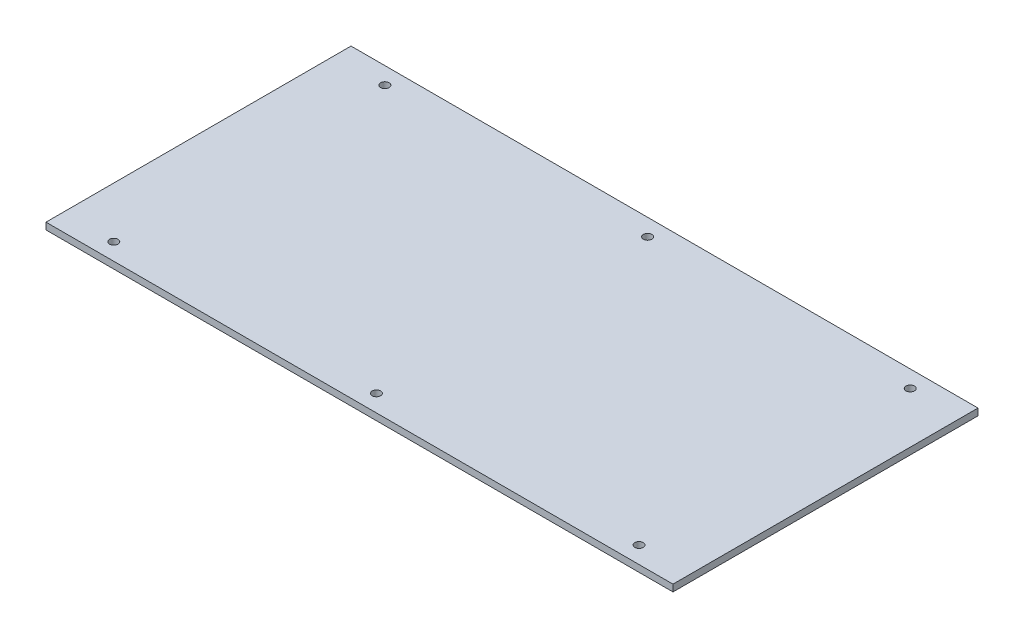
ISO-10303-21;
HEADER;
FILE_DESCRIPTION(('STEP AP214'),'2;1');
FILE_NAME('part.step','',(''),(''),'','','');
FILE_SCHEMA(('AUTOMOTIVE_DESIGN { 1 0 10303 214 1 1 1 1 }'));
ENDSEC;
DATA;
#1=APPLICATION_CONTEXT('core data for automotive mechanical design processes');
#2=APPLICATION_PROTOCOL_DEFINITION('international standard','automotive_design',2000,#1);
#3=PRODUCT_CONTEXT('',#1,'mechanical');
#4=PRODUCT('Part','Part','',(#3));
#5=PRODUCT_RELATED_PRODUCT_CATEGORY('part','',(#4));
#6=PRODUCT_DEFINITION_FORMATION('','',#4);
#7=PRODUCT_DEFINITION_CONTEXT('part definition',#1,'design');
#8=PRODUCT_DEFINITION('design','',#6,#7);
#9=PRODUCT_DEFINITION_SHAPE('','',#8);
#10=(LENGTH_UNIT() NAMED_UNIT(*) SI_UNIT(.MILLI.,.METRE.));
#11=(NAMED_UNIT(*) PLANE_ANGLE_UNIT() SI_UNIT($,.RADIAN.));
#12=(NAMED_UNIT(*) SI_UNIT($,.STERADIAN.) SOLID_ANGLE_UNIT());
#13=UNCERTAINTY_MEASURE_WITH_UNIT(LENGTH_MEASURE(1.E-05),#10,'distance_accuracy_value','');
#14=(GEOMETRIC_REPRESENTATION_CONTEXT(3) GLOBAL_UNCERTAINTY_ASSIGNED_CONTEXT((#13)) GLOBAL_UNIT_ASSIGNED_CONTEXT((#10,
#11,#12)) REPRESENTATION_CONTEXT('',''));
#15=CARTESIAN_POINT('',(0.,0.,0.));
#16=DIRECTION('',(0.,0.,1.));
#17=DIRECTION('',(1.,0.,0.));
#18=AXIS2_PLACEMENT_3D('',#15,#16,#17);
#19=CARTESIAN_POINT('',(0.,4.,0.));
#20=DIRECTION('',(0.,-1.,0.));
#21=DIRECTION('',(0.,0.,-1.));
#22=AXIS2_PLACEMENT_3D('',#19,#20,#21);
#23=PLANE('',#22);
#24=DIRECTION('',(0.,0.,-1.));
#25=VECTOR('',#24,1.);
#26=CARTESIAN_POINT('',(185.,4.,90.));
#27=LINE('',#26,#25);
#28=CARTESIAN_POINT('',(185.,4.,90.));
#29=VERTEX_POINT('',#28);
#30=CARTESIAN_POINT('',(185.,4.,-90.));
#31=VERTEX_POINT('',#30);
#32=EDGE_CURVE('E88',#29,#31,#27,.T.);
#33=ORIENTED_EDGE('',*,*,#32,.T.);
#34=DIRECTION('',(-1.,0.,0.));
#35=VECTOR('',#34,1.);
#36=CARTESIAN_POINT('',(-185.,4.,-90.));
#37=LINE('',#36,#35);
#38=CARTESIAN_POINT('',(-185.,4.,-90.));
#39=VERTEX_POINT('',#38);
#40=EDGE_CURVE('E83',#31,#39,#37,.T.);
#41=ORIENTED_EDGE('',*,*,#40,.T.);
#42=DIRECTION('',(0.,0.,1.));
#43=VECTOR('',#42,1.);
#44=CARTESIAN_POINT('',(-185.,4.,90.));
#45=LINE('',#44,#43);
#46=CARTESIAN_POINT('',(-185.,4.,90.));
#47=VERTEX_POINT('',#46);
#48=EDGE_CURVE('E86',#39,#47,#45,.T.);
#49=ORIENTED_EDGE('',*,*,#48,.T.);
#50=DIRECTION('',(1.,0.,0.));
#51=VECTOR('',#50,1.);
#52=CARTESIAN_POINT('',(-185.,4.,90.));
#53=LINE('',#52,#51);
#54=EDGE_CURVE('E53',#47,#29,#53,.T.);
#55=ORIENTED_EDGE('',*,*,#54,.T.);
#56=EDGE_LOOP('',(#33,#41,#49,#55));
#57=FACE_BOUND('',#56,.T.);
#58=CARTESIAN_POINT('',(-155.,4.,-80.));
#59=DIRECTION('',(0.,1.,0.));
#60=DIRECTION('',(0.,0.,1.));
#61=AXIS2_PLACEMENT_3D('',#58,#59,#60);
#62=CIRCLE('',#61,2.5);
#63=CARTESIAN_POINT('',(-155.,4.,-77.5));
#64=VERTEX_POINT('',#63);
#65=EDGE_CURVE('E103',#64,#64,#62,.T.);
#66=ORIENTED_EDGE('',*,*,#65,.F.);
#67=EDGE_LOOP('',(#66));
#68=FACE_BOUND('',#67,.T.);
#69=CARTESIAN_POINT('',(155.,4.,-80.));
#70=DIRECTION('',(0.,1.,0.));
#71=DIRECTION('',(0.,0.,-1.));
#72=AXIS2_PLACEMENT_3D('',#69,#70,#71);
#73=CIRCLE('',#72,2.5);
#74=CARTESIAN_POINT('',(155.,4.,-82.5));
#75=VERTEX_POINT('',#74);
#76=EDGE_CURVE('E118',#75,#75,#73,.T.);
#77=ORIENTED_EDGE('',*,*,#76,.F.);
#78=EDGE_LOOP('',(#77));
#79=FACE_BOUND('',#78,.T.);
#80=CARTESIAN_POINT('',(0.,4.,-80.));
#81=DIRECTION('',(0.,1.,0.));
#82=DIRECTION('',(0.,0.,1.));
#83=AXIS2_PLACEMENT_3D('',#80,#81,#82);
#84=CIRCLE('',#83,2.5);
#85=CARTESIAN_POINT('',(0.,4.,-77.5));
#86=VERTEX_POINT('',#85);
#87=EDGE_CURVE('E124',#86,#86,#84,.T.);
#88=ORIENTED_EDGE('',*,*,#87,.F.);
#89=EDGE_LOOP('',(#88));
#90=FACE_BOUND('',#89,.T.);
#91=CARTESIAN_POINT('',(-155.,4.,80.));
#92=DIRECTION('',(0.,1.,0.));
#93=DIRECTION('',(0.,0.,-1.));
#94=AXIS2_PLACEMENT_3D('',#91,#92,#93);
#95=CIRCLE('',#94,2.5);
#96=CARTESIAN_POINT('',(-155.,4.,77.5));
#97=VERTEX_POINT('',#96);
#98=EDGE_CURVE('E130',#97,#97,#95,.T.);
#99=ORIENTED_EDGE('',*,*,#98,.F.);
#100=EDGE_LOOP('',(#99));
#101=FACE_BOUND('',#100,.T.);
#102=CARTESIAN_POINT('',(0.,4.,80.0000000000001));
#103=DIRECTION('',(0.,1.,0.));
#104=DIRECTION('',(0.,0.,-1.));
#105=AXIS2_PLACEMENT_3D('',#102,#103,#104);
#106=CIRCLE('',#105,2.5);
#107=CARTESIAN_POINT('',(0.,4.,77.5000000000001));
#108=VERTEX_POINT('',#107);
#109=EDGE_CURVE('E136',#108,#108,#106,.T.);
#110=ORIENTED_EDGE('',*,*,#109,.F.);
#111=EDGE_LOOP('',(#110));
#112=FACE_BOUND('',#111,.T.);
#113=CARTESIAN_POINT('',(155.,4.,80.));
#114=DIRECTION('',(0.,1.,0.));
#115=DIRECTION('',(0.,0.,1.));
#116=AXIS2_PLACEMENT_3D('',#113,#114,#115);
#117=CIRCLE('',#116,2.5);
#118=CARTESIAN_POINT('',(155.,4.,82.5));
#119=VERTEX_POINT('',#118);
#120=EDGE_CURVE('E142',#119,#119,#117,.T.);
#121=ORIENTED_EDGE('',*,*,#120,.F.);
#122=EDGE_LOOP('',(#121));
#123=FACE_BOUND('',#122,.T.);
#124=ADVANCED_FACE('F36',(#57,#68,#79,#90,#101,#112,#123),#23,.F.);
#125=CARTESIAN_POINT('',(0.,0.,0.));
#126=DIRECTION('',(0.,-1.,0.));
#127=DIRECTION('',(0.,0.,-1.));
#128=AXIS2_PLACEMENT_3D('',#125,#126,#127);
#129=PLANE('',#128);
#130=CARTESIAN_POINT('',(0.,0.,80.0000000000001));
#131=DIRECTION('',(0.,1.,0.));
#132=DIRECTION('',(0.,0.,-1.));
#133=AXIS2_PLACEMENT_3D('',#130,#131,#132);
#134=CIRCLE('',#133,2.5);
#135=CARTESIAN_POINT('',(0.,0.,77.5000000000001));
#136=VERTEX_POINT('',#135);
#137=EDGE_CURVE('E139',#136,#136,#134,.T.);
#138=ORIENTED_EDGE('',*,*,#137,.T.);
#139=EDGE_LOOP('',(#138));
#140=FACE_BOUND('',#139,.T.);
#141=CARTESIAN_POINT('',(0.,0.,-80.));
#142=DIRECTION('',(0.,1.,0.));
#143=DIRECTION('',(0.,0.,1.));
#144=AXIS2_PLACEMENT_3D('',#141,#142,#143);
#145=CIRCLE('',#144,2.5);
#146=CARTESIAN_POINT('',(0.,0.,-77.5));
#147=VERTEX_POINT('',#146);
#148=EDGE_CURVE('E127',#147,#147,#145,.T.);
#149=ORIENTED_EDGE('',*,*,#148,.T.);
#150=EDGE_LOOP('',(#149));
#151=FACE_BOUND('',#150,.T.);
#152=CARTESIAN_POINT('',(-155.,0.,-80.));
#153=DIRECTION('',(0.,1.,0.));
#154=DIRECTION('',(0.,0.,1.));
#155=AXIS2_PLACEMENT_3D('',#152,#153,#154);
#156=CIRCLE('',#155,2.5);
#157=CARTESIAN_POINT('',(-155.,0.,-77.5));
#158=VERTEX_POINT('',#157);
#159=EDGE_CURVE('E115',#158,#158,#156,.T.);
#160=ORIENTED_EDGE('',*,*,#159,.T.);
#161=EDGE_LOOP('',(#160));
#162=FACE_BOUND('',#161,.T.);
#163=DIRECTION('',(0.,0.,-1.));
#164=VECTOR('',#163,1.);
#165=CARTESIAN_POINT('',(185.,0.,90.));
#166=LINE('',#165,#164);
#167=CARTESIAN_POINT('',(185.,0.,90.));
#168=VERTEX_POINT('',#167);
#169=CARTESIAN_POINT('',(185.,0.,-90.));
#170=VERTEX_POINT('',#169);
#171=EDGE_CURVE('E100',#168,#170,#166,.T.);
#172=ORIENTED_EDGE('',*,*,#171,.F.);
#173=DIRECTION('',(1.,0.,0.));
#174=VECTOR('',#173,1.);
#175=CARTESIAN_POINT('',(-185.,0.,90.));
#176=LINE('',#175,#174);
#177=CARTESIAN_POINT('',(-185.,0.,90.));
#178=VERTEX_POINT('',#177);
#179=EDGE_CURVE('E76',#178,#168,#176,.T.);
#180=ORIENTED_EDGE('',*,*,#179,.F.);
#181=DIRECTION('',(0.,0.,1.));
#182=VECTOR('',#181,1.);
#183=CARTESIAN_POINT('',(-185.,0.,90.));
#184=LINE('',#183,#182);
#185=CARTESIAN_POINT('',(-185.,0.,-90.));
#186=VERTEX_POINT('',#185);
#187=EDGE_CURVE('E70',#186,#178,#184,.T.);
#188=ORIENTED_EDGE('',*,*,#187,.F.);
#189=DIRECTION('',(-1.,0.,0.));
#190=VECTOR('',#189,1.);
#191=CARTESIAN_POINT('',(-185.,0.,-90.));
#192=LINE('',#191,#190);
#193=EDGE_CURVE('E92',#170,#186,#192,.T.);
#194=ORIENTED_EDGE('',*,*,#193,.F.);
#195=EDGE_LOOP('',(#172,#180,#188,#194));
#196=FACE_BOUND('',#195,.T.);
#197=CARTESIAN_POINT('',(155.,0.,-80.));
#198=DIRECTION('',(0.,1.,0.));
#199=DIRECTION('',(0.,0.,-1.));
#200=AXIS2_PLACEMENT_3D('',#197,#198,#199);
#201=CIRCLE('',#200,2.5);
#202=CARTESIAN_POINT('',(155.,0.,-82.5));
#203=VERTEX_POINT('',#202);
#204=EDGE_CURVE('E121',#203,#203,#201,.T.);
#205=ORIENTED_EDGE('',*,*,#204,.T.);
#206=EDGE_LOOP('',(#205));
#207=FACE_BOUND('',#206,.T.);
#208=CARTESIAN_POINT('',(-155.,0.,80.));
#209=DIRECTION('',(0.,1.,0.));
#210=DIRECTION('',(0.,0.,-1.));
#211=AXIS2_PLACEMENT_3D('',#208,#209,#210);
#212=CIRCLE('',#211,2.5);
#213=CARTESIAN_POINT('',(-155.,0.,77.5));
#214=VERTEX_POINT('',#213);
#215=EDGE_CURVE('E133',#214,#214,#212,.T.);
#216=ORIENTED_EDGE('',*,*,#215,.T.);
#217=EDGE_LOOP('',(#216));
#218=FACE_BOUND('',#217,.T.);
#219=CARTESIAN_POINT('',(155.,0.,80.));
#220=DIRECTION('',(0.,1.,0.));
#221=DIRECTION('',(0.,0.,1.));
#222=AXIS2_PLACEMENT_3D('',#219,#220,#221);
#223=CIRCLE('',#222,2.5);
#224=CARTESIAN_POINT('',(155.,0.,82.5));
#225=VERTEX_POINT('',#224);
#226=EDGE_CURVE('E145',#225,#225,#223,.T.);
#227=ORIENTED_EDGE('',*,*,#226,.T.);
#228=EDGE_LOOP('',(#227));
#229=FACE_BOUND('',#228,.T.);
#230=ADVANCED_FACE('F111',(#140,#151,#162,#196,#207,#218,#229),#129,.T.);
#231=CARTESIAN_POINT('',(185.,4.,90.));
#232=DIRECTION('',(-1.,0.,0.));
#233=DIRECTION('',(0.,0.,1.));
#234=AXIS2_PLACEMENT_3D('',#231,#232,#233);
#235=PLANE('',#234);
#236=ORIENTED_EDGE('',*,*,#171,.T.);
#237=DIRECTION('',(0.,-1.,0.));
#238=VECTOR('',#237,1.);
#239=CARTESIAN_POINT('',(185.,4.,-90.));
#240=LINE('',#239,#238);
#241=EDGE_CURVE('E11',#31,#170,#240,.T.);
#242=ORIENTED_EDGE('',*,*,#241,.F.);
#243=ORIENTED_EDGE('',*,*,#32,.F.);
#244=DIRECTION('',(0.,-1.,0.));
#245=VECTOR('',#244,1.);
#246=CARTESIAN_POINT('',(185.,4.,90.));
#247=LINE('',#246,#245);
#248=EDGE_CURVE('E96',#29,#168,#247,.T.);
#249=ORIENTED_EDGE('',*,*,#248,.T.);
#250=EDGE_LOOP('',(#236,#242,#243,#249));
#251=FACE_BOUND('',#250,.T.);
#252=ADVANCED_FACE('F38',(#251),#235,.F.);
#253=CARTESIAN_POINT('',(-185.,4.,-90.));
#254=DIRECTION('',(0.,0.,1.));
#255=DIRECTION('',(1.,0.,0.));
#256=AXIS2_PLACEMENT_3D('',#253,#254,#255);
#257=PLANE('',#256);
#258=ORIENTED_EDGE('',*,*,#193,.T.);
#259=DIRECTION('',(0.,-1.,0.));
#260=VECTOR('',#259,1.);
#261=CARTESIAN_POINT('',(-185.,4.,-90.));
#262=LINE('',#261,#260);
#263=EDGE_CURVE('E45',#39,#186,#262,.T.);
#264=ORIENTED_EDGE('',*,*,#263,.F.);
#265=ORIENTED_EDGE('',*,*,#40,.F.);
#266=ORIENTED_EDGE('',*,*,#241,.T.);
#267=EDGE_LOOP('',(#258,#264,#265,#266));
#268=FACE_BOUND('',#267,.T.);
#269=ADVANCED_FACE('F91',(#268),#257,.F.);
#270=CARTESIAN_POINT('',(-185.,4.,90.));
#271=DIRECTION('',(1.,0.,0.));
#272=DIRECTION('',(0.,0.,-1.));
#273=AXIS2_PLACEMENT_3D('',#270,#271,#272);
#274=PLANE('',#273);
#275=ORIENTED_EDGE('',*,*,#187,.T.);
#276=DIRECTION('',(0.,-1.,0.));
#277=VECTOR('',#276,1.);
#278=CARTESIAN_POINT('',(-185.,4.,90.));
#279=LINE('',#278,#277);
#280=EDGE_CURVE('E93',#47,#178,#279,.T.);
#281=ORIENTED_EDGE('',*,*,#280,.F.);
#282=ORIENTED_EDGE('',*,*,#48,.F.);
#283=ORIENTED_EDGE('',*,*,#263,.T.);
#284=EDGE_LOOP('',(#275,#281,#282,#283));
#285=FACE_BOUND('',#284,.T.);
#286=ADVANCED_FACE('F94',(#285),#274,.F.);
#287=CARTESIAN_POINT('',(-185.,4.,90.));
#288=DIRECTION('',(0.,0.,-1.));
#289=DIRECTION('',(-1.,0.,0.));
#290=AXIS2_PLACEMENT_3D('',#287,#288,#289);
#291=PLANE('',#290);
#292=ORIENTED_EDGE('',*,*,#179,.T.);
#293=ORIENTED_EDGE('',*,*,#248,.F.);
#294=ORIENTED_EDGE('',*,*,#54,.F.);
#295=ORIENTED_EDGE('',*,*,#280,.T.);
#296=EDGE_LOOP('',(#292,#293,#294,#295));
#297=FACE_BOUND('',#296,.T.);
#298=ADVANCED_FACE('F108',(#297),#291,.F.);
#299=CARTESIAN_POINT('',(-155.,4.,-80.));
#300=DIRECTION('',(0.,-1.,0.));
#301=DIRECTION('',(0.,0.,-1.));
#302=AXIS2_PLACEMENT_3D('',#299,#300,#301);
#303=CYLINDRICAL_SURFACE('',#302,2.5);
#304=ORIENTED_EDGE('',*,*,#65,.T.);
#305=EDGE_LOOP('',(#304));
#306=FACE_BOUND('',#305,.T.);
#307=ORIENTED_EDGE('',*,*,#159,.F.);
#308=EDGE_LOOP('',(#307));
#309=FACE_BOUND('',#308,.T.);
#310=ADVANCED_FACE('F162',(#306,#309),#303,.F.);
#311=CARTESIAN_POINT('',(155.,4.,-80.));
#312=DIRECTION('',(0.,-1.,0.));
#313=DIRECTION('',(0.,0.,-1.));
#314=AXIS2_PLACEMENT_3D('',#311,#312,#313);
#315=CYLINDRICAL_SURFACE('',#314,2.5);
#316=ORIENTED_EDGE('',*,*,#76,.T.);
#317=EDGE_LOOP('',(#316));
#318=FACE_BOUND('',#317,.T.);
#319=ORIENTED_EDGE('',*,*,#204,.F.);
#320=EDGE_LOOP('',(#319));
#321=FACE_BOUND('',#320,.T.);
#322=ADVANCED_FACE('F208',(#318,#321),#315,.F.);
#323=CARTESIAN_POINT('',(0.,4.,-80.));
#324=DIRECTION('',(0.,-1.,0.));
#325=DIRECTION('',(0.,0.,-1.));
#326=AXIS2_PLACEMENT_3D('',#323,#324,#325);
#327=CYLINDRICAL_SURFACE('',#326,2.5);
#328=ORIENTED_EDGE('',*,*,#87,.T.);
#329=EDGE_LOOP('',(#328));
#330=FACE_BOUND('',#329,.T.);
#331=ORIENTED_EDGE('',*,*,#148,.F.);
#332=EDGE_LOOP('',(#331));
#333=FACE_BOUND('',#332,.T.);
#334=ADVANCED_FACE('F216',(#330,#333),#327,.F.);
#335=CARTESIAN_POINT('',(-155.,4.,80.));
#336=DIRECTION('',(0.,-1.,0.));
#337=DIRECTION('',(0.,0.,-1.));
#338=AXIS2_PLACEMENT_3D('',#335,#336,#337);
#339=CYLINDRICAL_SURFACE('',#338,2.5);
#340=ORIENTED_EDGE('',*,*,#98,.T.);
#341=EDGE_LOOP('',(#340));
#342=FACE_BOUND('',#341,.T.);
#343=ORIENTED_EDGE('',*,*,#215,.F.);
#344=EDGE_LOOP('',(#343));
#345=FACE_BOUND('',#344,.T.);
#346=ADVANCED_FACE('F224',(#342,#345),#339,.F.);
#347=CARTESIAN_POINT('',(0.,4.,80.0000000000001));
#348=DIRECTION('',(0.,-1.,0.));
#349=DIRECTION('',(0.,0.,-1.));
#350=AXIS2_PLACEMENT_3D('',#347,#348,#349);
#351=CYLINDRICAL_SURFACE('',#350,2.5);
#352=ORIENTED_EDGE('',*,*,#109,.T.);
#353=EDGE_LOOP('',(#352));
#354=FACE_BOUND('',#353,.T.);
#355=ORIENTED_EDGE('',*,*,#137,.F.);
#356=EDGE_LOOP('',(#355));
#357=FACE_BOUND('',#356,.T.);
#358=ADVANCED_FACE('F233',(#354,#357),#351,.F.);
#359=CARTESIAN_POINT('',(155.,4.,80.));
#360=DIRECTION('',(0.,-1.,0.));
#361=DIRECTION('',(0.,0.,-1.));
#362=AXIS2_PLACEMENT_3D('',#359,#360,#361);
#363=CYLINDRICAL_SURFACE('',#362,2.5);
#364=ORIENTED_EDGE('',*,*,#120,.T.);
#365=EDGE_LOOP('',(#364));
#366=FACE_BOUND('',#365,.T.);
#367=ORIENTED_EDGE('',*,*,#226,.F.);
#368=EDGE_LOOP('',(#367));
#369=FACE_BOUND('',#368,.T.);
#370=ADVANCED_FACE('F151',(#366,#369),#363,.F.);
#371=CLOSED_SHELL('',(#124,#230,#252,#269,#286,#298,#310,#322,#334,#346,#358,#370));
#372=MANIFOLD_SOLID_BREP('B2',#371);
#373=ADVANCED_BREP_SHAPE_REPRESENTATION('',(#18,#372),#14);
#374=SHAPE_DEFINITION_REPRESENTATION(#9,#373);
ENDSEC;
END-ISO-10303-21;
